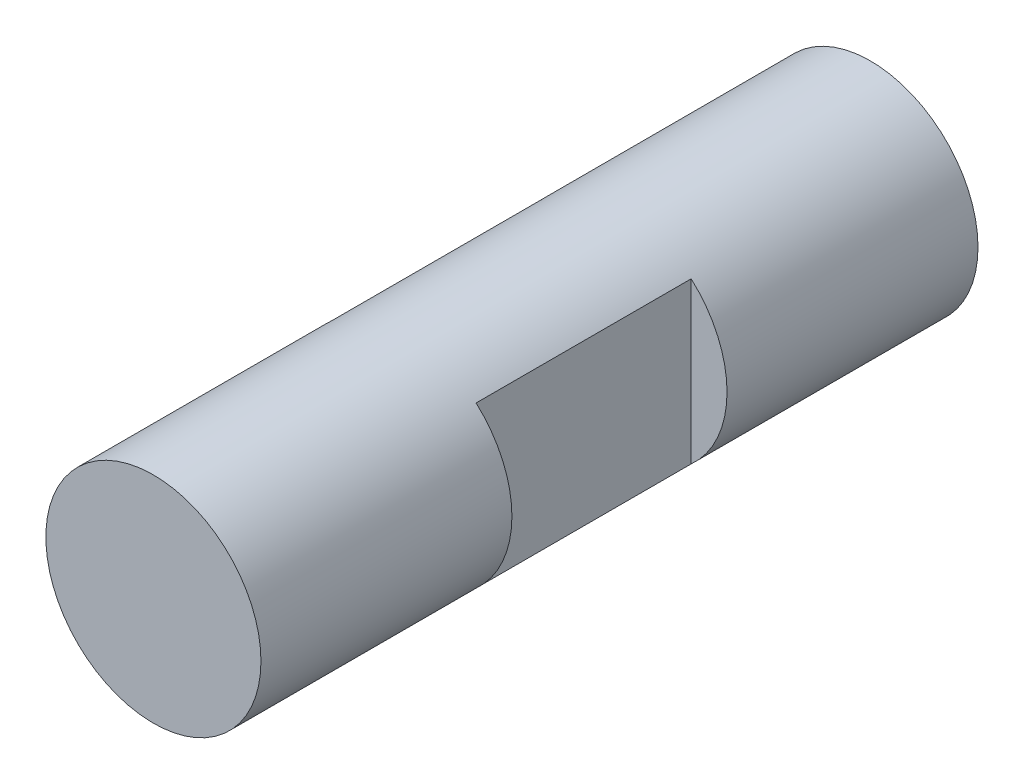
ISO-10303-21;
HEADER;
FILE_DESCRIPTION(('STEP AP214'),'2;1');
FILE_NAME('part.step','',(''),(''),'','','');
FILE_SCHEMA(('AUTOMOTIVE_DESIGN { 1 0 10303 214 1 1 1 1 }'));
ENDSEC;
DATA;
#1=APPLICATION_CONTEXT('core data for automotive mechanical design processes');
#2=APPLICATION_PROTOCOL_DEFINITION('international standard','automotive_design',2000,#1);
#3=PRODUCT_CONTEXT('',#1,'mechanical');
#4=PRODUCT('Part','Part','',(#3));
#5=PRODUCT_RELATED_PRODUCT_CATEGORY('part','',(#4));
#6=PRODUCT_DEFINITION_FORMATION('','',#4);
#7=PRODUCT_DEFINITION_CONTEXT('part definition',#1,'design');
#8=PRODUCT_DEFINITION('design','',#6,#7);
#9=PRODUCT_DEFINITION_SHAPE('','',#8);
#10=(LENGTH_UNIT() NAMED_UNIT(*) SI_UNIT(.MILLI.,.METRE.));
#11=(NAMED_UNIT(*) PLANE_ANGLE_UNIT() SI_UNIT($,.RADIAN.));
#12=(NAMED_UNIT(*) SI_UNIT($,.STERADIAN.) SOLID_ANGLE_UNIT());
#13=UNCERTAINTY_MEASURE_WITH_UNIT(LENGTH_MEASURE(1.E-05),#10,'distance_accuracy_value','');
#14=(GEOMETRIC_REPRESENTATION_CONTEXT(3) GLOBAL_UNCERTAINTY_ASSIGNED_CONTEXT((#13)) GLOBAL_UNIT_ASSIGNED_CONTEXT((#10,
#11,#12)) REPRESENTATION_CONTEXT('',''));
#15=CARTESIAN_POINT('',(0.,0.,0.));
#16=DIRECTION('',(0.,0.,1.));
#17=DIRECTION('',(1.,0.,0.));
#18=AXIS2_PLACEMENT_3D('',#15,#16,#17);
#19=CARTESIAN_POINT('',(0.,0.,40.));
#20=DIRECTION('',(0.,0.,-1.));
#21=DIRECTION('',(-1.,0.,0.));
#22=AXIS2_PLACEMENT_3D('',#19,#20,#21);
#23=CYLINDRICAL_SURFACE('',#22,6.);
#24=CARTESIAN_POINT('',(0.,0.,23.6905989232415));
#25=DIRECTION('',(-0.500000000000001,0.,-0.866025403784438));
#26=DIRECTION('',(0.866025403784438,0.,-0.500000000000001));
#27=AXIS2_PLACEMENT_3D('',#24,#25,#26);
#28=ELLIPSE('',#27,6.92820323027551,6.);
#29=CARTESIAN_POINT('',(-4.,4.47213595499958,26.));
#30=VERTEX_POINT('',#29);
#31=CARTESIAN_POINT('',(-4.,-4.47213595499958,26.));
#32=VERTEX_POINT('',#31);
#33=EDGE_CURVE('E39',#30,#32,#28,.F.);
#34=ORIENTED_EDGE('',*,*,#33,.T.);
#35=DIRECTION('',(0.,0.,-1.));
#36=VECTOR('',#35,1.);
#37=CARTESIAN_POINT('',(-4.,-4.47213595499958,40.));
#38=LINE('',#37,#36);
#39=CARTESIAN_POINT('',(-4.,-4.47213595499958,14.));
#40=VERTEX_POINT('',#39);
#41=EDGE_CURVE('E11',#32,#40,#38,.T.);
#42=ORIENTED_EDGE('',*,*,#41,.T.);
#43=CARTESIAN_POINT('',(0.,0.,14.));
#44=DIRECTION('',(0.,0.,-1.));
#45=DIRECTION('',(0.,1.,0.));
#46=AXIS2_PLACEMENT_3D('',#43,#44,#45);
#47=CIRCLE('',#46,6.);
#48=CARTESIAN_POINT('',(-4.,4.47213595499958,14.));
#49=VERTEX_POINT('',#48);
#50=EDGE_CURVE('E44',#40,#49,#47,.T.);
#51=ORIENTED_EDGE('',*,*,#50,.T.);
#52=DIRECTION('',(0.,0.,-1.));
#53=VECTOR('',#52,1.);
#54=CARTESIAN_POINT('',(-4.,4.47213595499958,40.));
#55=LINE('',#54,#53);
#56=EDGE_CURVE('E84',#49,#30,#55,.F.);
#57=ORIENTED_EDGE('',*,*,#56,.T.);
#58=EDGE_LOOP('',(#34,#42,#51,#57));
#59=FACE_BOUND('',#58,.T.);
#60=CARTESIAN_POINT('',(0.,0.,26.));
#61=DIRECTION('',(0.,0.,-1.));
#62=DIRECTION('',(-1.,0.,0.));
#63=AXIS2_PLACEMENT_3D('',#60,#61,#62);
#64=CIRCLE('',#63,6.);
#65=CARTESIAN_POINT('',(4.,4.47213595499958,26.));
#66=VERTEX_POINT('',#65);
#67=CARTESIAN_POINT('',(4.,-4.47213595499958,26.));
#68=VERTEX_POINT('',#67);
#69=EDGE_CURVE('E96',#66,#68,#64,.T.);
#70=ORIENTED_EDGE('',*,*,#69,.F.);
#71=DIRECTION('',(0.,0.,-1.));
#72=VECTOR('',#71,1.);
#73=CARTESIAN_POINT('',(4.,4.47213595499958,40.));
#74=LINE('',#73,#72);
#75=CARTESIAN_POINT('',(4.,4.47213595499958,14.));
#76=VERTEX_POINT('',#75);
#77=EDGE_CURVE('E89',#66,#76,#74,.T.);
#78=ORIENTED_EDGE('',*,*,#77,.T.);
#79=CARTESIAN_POINT('',(0.,0.,14.));
#80=DIRECTION('',(0.,0.,1.));
#81=DIRECTION('',(0.,-1.,0.));
#82=AXIS2_PLACEMENT_3D('',#79,#80,#81);
#83=CIRCLE('',#82,6.);
#84=CARTESIAN_POINT('',(4.,-4.47213595499958,14.));
#85=VERTEX_POINT('',#84);
#86=EDGE_CURVE('E92',#85,#76,#83,.T.);
#87=ORIENTED_EDGE('',*,*,#86,.F.);
#88=DIRECTION('',(0.,0.,-1.));
#89=VECTOR('',#88,1.);
#90=CARTESIAN_POINT('',(4.,-4.47213595499958,40.));
#91=LINE('',#90,#89);
#92=EDGE_CURVE('E98',#85,#68,#91,.F.);
#93=ORIENTED_EDGE('',*,*,#92,.T.);
#94=EDGE_LOOP('',(#70,#78,#87,#93));
#95=FACE_BOUND('',#94,.T.);
#96=CARTESIAN_POINT('',(0.,0.,40.));
#97=DIRECTION('',(0.,0.,1.));
#98=DIRECTION('',(1.,0.,0.));
#99=AXIS2_PLACEMENT_3D('',#96,#97,#98);
#100=CIRCLE('',#99,6.);
#101=CARTESIAN_POINT('',(6.,0.,40.));
#102=VERTEX_POINT('',#101);
#103=EDGE_CURVE('E101',#102,#102,#100,.T.);
#104=ORIENTED_EDGE('',*,*,#103,.F.);
#105=EDGE_LOOP('',(#104));
#106=FACE_BOUND('',#105,.T.);
#107=CARTESIAN_POINT('',(0.,0.,0.));
#108=DIRECTION('',(0.,0.,1.));
#109=DIRECTION('',(1.,0.,0.));
#110=AXIS2_PLACEMENT_3D('',#107,#108,#109);
#111=CIRCLE('',#110,6.);
#112=CARTESIAN_POINT('',(6.,0.,0.));
#113=VERTEX_POINT('',#112);
#114=EDGE_CURVE('E102',#113,#113,#111,.T.);
#115=ORIENTED_EDGE('',*,*,#114,.T.);
#116=EDGE_LOOP('',(#115));
#117=FACE_BOUND('',#116,.T.);
#118=ADVANCED_FACE('F35',(#59,#95,#106,#117),#23,.T.);
#119=CARTESIAN_POINT('',(0.,0.,40.));
#120=DIRECTION('',(0.,0.,1.));
#121=DIRECTION('',(1.,0.,0.));
#122=AXIS2_PLACEMENT_3D('',#119,#120,#121);
#123=PLANE('',#122);
#124=ORIENTED_EDGE('',*,*,#103,.T.);
#125=EDGE_LOOP('',(#124));
#126=FACE_BOUND('',#125,.T.);
#127=ADVANCED_FACE('F120',(#126),#123,.T.);
#128=CARTESIAN_POINT('',(0.,0.,0.));
#129=DIRECTION('',(0.,0.,1.));
#130=DIRECTION('',(1.,0.,0.));
#131=AXIS2_PLACEMENT_3D('',#128,#129,#130);
#132=PLANE('',#131);
#133=ORIENTED_EDGE('',*,*,#114,.F.);
#134=EDGE_LOOP('',(#133));
#135=FACE_BOUND('',#134,.T.);
#136=ADVANCED_FACE('F124',(#135),#132,.F.);
#137=CARTESIAN_POINT('',(44.,-4.5,14.));
#138=DIRECTION('',(0.,0.,1.));
#139=DIRECTION('',(0.,-1.,0.));
#140=AXIS2_PLACEMENT_3D('',#137,#138,#139);
#141=PLANE('',#140);
#142=ORIENTED_EDGE('',*,*,#86,.T.);
#143=DIRECTION('',(0.,1.,0.));
#144=VECTOR('',#143,1.);
#145=CARTESIAN_POINT('',(4.,-4.5,14.));
#146=LINE('',#145,#144);
#147=EDGE_CURVE('E108',#85,#76,#146,.T.);
#148=ORIENTED_EDGE('',*,*,#147,.F.);
#149=EDGE_LOOP('',(#142,#148));
#150=FACE_BOUND('',#149,.T.);
#151=ADVANCED_FACE('F129',(#150),#141,.T.);
#152=CARTESIAN_POINT('',(44.,-4.5,26.));
#153=DIRECTION('',(0.,0.,-1.));
#154=DIRECTION('',(-1.,0.,0.));
#155=AXIS2_PLACEMENT_3D('',#152,#153,#154);
#156=PLANE('',#155);
#157=ORIENTED_EDGE('',*,*,#69,.T.);
#158=DIRECTION('',(0.,-1.,0.));
#159=VECTOR('',#158,1.);
#160=CARTESIAN_POINT('',(4.,-4.5,26.));
#161=LINE('',#160,#159);
#162=EDGE_CURVE('E59',#66,#68,#161,.T.);
#163=ORIENTED_EDGE('',*,*,#162,.F.);
#164=EDGE_LOOP('',(#157,#163));
#165=FACE_BOUND('',#164,.T.);
#166=ADVANCED_FACE('F134',(#165),#156,.T.);
#167=CARTESIAN_POINT('',(4.,0.,0.));
#168=DIRECTION('',(-1.,0.,0.));
#169=DIRECTION('',(0.,0.,1.));
#170=AXIS2_PLACEMENT_3D('',#167,#168,#169);
#171=PLANE('',#170);
#172=ORIENTED_EDGE('',*,*,#162,.T.);
#173=ORIENTED_EDGE('',*,*,#92,.F.);
#174=ORIENTED_EDGE('',*,*,#147,.T.);
#175=ORIENTED_EDGE('',*,*,#77,.F.);
#176=EDGE_LOOP('',(#172,#173,#174,#175));
#177=FACE_BOUND('',#176,.T.);
#178=ADVANCED_FACE('F117',(#177),#171,.F.);
#179=CARTESIAN_POINT('',(-44.,-4.5,14.));
#180=DIRECTION('',(0.,0.,-1.));
#181=DIRECTION('',(0.,1.,0.));
#182=AXIS2_PLACEMENT_3D('',#179,#180,#181);
#183=PLANE('',#182);
#184=DIRECTION('',(0.,1.,0.));
#185=VECTOR('',#184,1.);
#186=CARTESIAN_POINT('',(-4.,-4.5,14.));
#187=LINE('',#186,#185);
#188=EDGE_CURVE('E79',#40,#49,#187,.T.);
#189=ORIENTED_EDGE('',*,*,#188,.T.);
#190=ORIENTED_EDGE('',*,*,#50,.F.);
#191=EDGE_LOOP('',(#189,#190));
#192=FACE_BOUND('',#191,.T.);
#193=ADVANCED_FACE('F78',(#192),#183,.F.);
#194=CARTESIAN_POINT('',(-4.,-4.5,26.));
#195=DIRECTION('',(-0.500000000000001,0.,-0.866025403784438));
#196=DIRECTION('',(-0.866025403784438,0.,0.500000000000001));
#197=AXIS2_PLACEMENT_3D('',#194,#195,#196);
#198=PLANE('',#197);
#199=DIRECTION('',(0.,-1.,0.));
#200=VECTOR('',#199,1.);
#201=CARTESIAN_POINT('',(-4.,-4.5,26.));
#202=LINE('',#201,#200);
#203=EDGE_CURVE('E51',#30,#32,#202,.T.);
#204=ORIENTED_EDGE('',*,*,#203,.T.);
#205=ORIENTED_EDGE('',*,*,#33,.F.);
#206=EDGE_LOOP('',(#204,#205));
#207=FACE_BOUND('',#206,.T.);
#208=ADVANCED_FACE('F37',(#207),#198,.T.);
#209=CARTESIAN_POINT('',(-4.,0.,0.));
#210=DIRECTION('',(1.,0.,0.));
#211=DIRECTION('',(0.,0.,1.));
#212=AXIS2_PLACEMENT_3D('',#209,#210,#211);
#213=PLANE('',#212);
#214=ORIENTED_EDGE('',*,*,#203,.F.);
#215=ORIENTED_EDGE('',*,*,#56,.F.);
#216=ORIENTED_EDGE('',*,*,#188,.F.);
#217=ORIENTED_EDGE('',*,*,#41,.F.);
#218=EDGE_LOOP('',(#214,#215,#216,#217));
#219=FACE_BOUND('',#218,.T.);
#220=ADVANCED_FACE('F83',(#219),#213,.F.);
#221=CLOSED_SHELL('',(#118,#127,#136,#151,#166,#178,#193,#208,#220));
#222=MANIFOLD_SOLID_BREP('B2',#221);
#223=ADVANCED_BREP_SHAPE_REPRESENTATION('',(#18,#222),#14);
#224=SHAPE_DEFINITION_REPRESENTATION(#9,#223);
ENDSEC;
END-ISO-10303-21;
